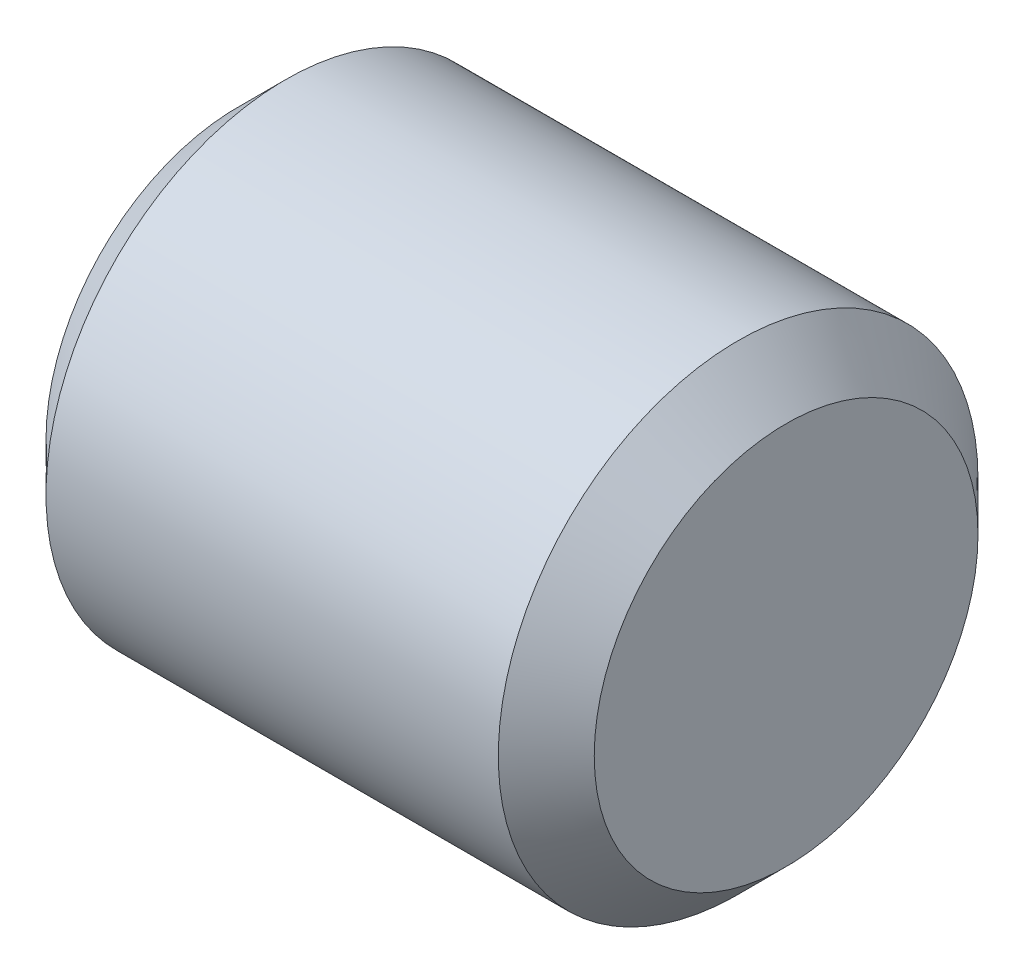
ISO-10303-21;
HEADER;
FILE_DESCRIPTION(('STEP AP214'),'2;1');
FILE_NAME('part.step','',(''),(''),'','','');
FILE_SCHEMA(('AUTOMOTIVE_DESIGN { 1 0 10303 214 1 1 1 1 }'));
ENDSEC;
DATA;
#1=APPLICATION_CONTEXT('core data for automotive mechanical design processes');
#2=APPLICATION_PROTOCOL_DEFINITION('international standard','automotive_design',2000,#1);
#3=PRODUCT_CONTEXT('',#1,'mechanical');
#4=PRODUCT('Part','Part','',(#3));
#5=PRODUCT_RELATED_PRODUCT_CATEGORY('part','',(#4));
#6=PRODUCT_DEFINITION_FORMATION('','',#4);
#7=PRODUCT_DEFINITION_CONTEXT('part definition',#1,'design');
#8=PRODUCT_DEFINITION('design','',#6,#7);
#9=PRODUCT_DEFINITION_SHAPE('','',#8);
#10=(LENGTH_UNIT() NAMED_UNIT(*) SI_UNIT(.MILLI.,.METRE.));
#11=(NAMED_UNIT(*) PLANE_ANGLE_UNIT() SI_UNIT($,.RADIAN.));
#12=(NAMED_UNIT(*) SI_UNIT($,.STERADIAN.) SOLID_ANGLE_UNIT());
#13=UNCERTAINTY_MEASURE_WITH_UNIT(LENGTH_MEASURE(1.E-05),#10,'distance_accuracy_value','');
#14=(GEOMETRIC_REPRESENTATION_CONTEXT(3) GLOBAL_UNCERTAINTY_ASSIGNED_CONTEXT((#13)) GLOBAL_UNIT_ASSIGNED_CONTEXT((#10,
#11,#12)) REPRESENTATION_CONTEXT('',''));
#15=CARTESIAN_POINT('',(0.,0.,0.));
#16=DIRECTION('',(0.,0.,1.));
#17=DIRECTION('',(1.,0.,0.));
#18=AXIS2_PLACEMENT_3D('',#15,#16,#17);
#19=CARTESIAN_POINT('',(-6.35,0.,0.));
#20=DIRECTION('',(1.,0.,0.));
#21=DIRECTION('',(0.,0.,-1.));
#22=AXIS2_PLACEMENT_3D('',#19,#20,#21);
#23=CYLINDRICAL_SURFACE('',#22,5.55625);
#24=CARTESIAN_POINT('',(5.23875,0.,0.));
#25=DIRECTION('',(1.,0.,0.));
#26=DIRECTION('',(0.,0.,-1.));
#27=AXIS2_PLACEMENT_3D('',#24,#25,#26);
#28=CIRCLE('',#27,5.55625);
#29=CARTESIAN_POINT('',(5.23875,0.,-5.55625));
#30=VERTEX_POINT('',#29);
#31=EDGE_CURVE('E40',#30,#30,#28,.F.);
#32=ORIENTED_EDGE('',*,*,#31,.T.);
#33=EDGE_LOOP('',(#32));
#34=FACE_BOUND('',#33,.T.);
#35=CARTESIAN_POINT('',(-5.23875,0.,0.));
#36=DIRECTION('',(1.,0.,0.));
#37=DIRECTION('',(0.,0.,-1.));
#38=AXIS2_PLACEMENT_3D('',#35,#36,#37);
#39=CIRCLE('',#38,5.55625);
#40=CARTESIAN_POINT('',(-5.23875,0.,-5.55625));
#41=VERTEX_POINT('',#40);
#42=EDGE_CURVE('E44',#41,#41,#39,.T.);
#43=ORIENTED_EDGE('',*,*,#42,.T.);
#44=EDGE_LOOP('',(#43));
#45=FACE_BOUND('',#44,.T.);
#46=ADVANCED_FACE('F33',(#34,#45),#23,.T.);
#47=CARTESIAN_POINT('',(-6.35,0.,0.));
#48=DIRECTION('',(1.,0.,0.));
#49=DIRECTION('',(0.,0.,-1.));
#50=AXIS2_PLACEMENT_3D('',#47,#48,#49);
#51=PLANE('',#50);
#52=CARTESIAN_POINT('',(-6.35,0.,0.));
#53=DIRECTION('',(1.,0.,0.));
#54=DIRECTION('',(0.,0.,-1.));
#55=AXIS2_PLACEMENT_3D('',#52,#53,#54);
#56=CIRCLE('',#55,4.445);
#57=CARTESIAN_POINT('',(-6.35,0.,-4.445));
#58=VERTEX_POINT('',#57);
#59=EDGE_CURVE('E10',#58,#58,#56,.F.);
#60=ORIENTED_EDGE('',*,*,#59,.T.);
#61=EDGE_LOOP('',(#60));
#62=FACE_BOUND('',#61,.T.);
#63=ADVANCED_FACE('F64',(#62),#51,.F.);
#64=CARTESIAN_POINT('',(6.35,0.,0.));
#65=DIRECTION('',(1.,0.,0.));
#66=DIRECTION('',(0.,0.,-1.));
#67=AXIS2_PLACEMENT_3D('',#64,#65,#66);
#68=PLANE('',#67);
#69=CARTESIAN_POINT('',(6.35,0.,0.));
#70=DIRECTION('',(1.,0.,0.));
#71=DIRECTION('',(0.,0.,-1.));
#72=AXIS2_PLACEMENT_3D('',#69,#70,#71);
#73=CIRCLE('',#72,4.445);
#74=CARTESIAN_POINT('',(6.35,0.,-4.445));
#75=VERTEX_POINT('',#74);
#76=EDGE_CURVE('E48',#75,#75,#73,.T.);
#77=ORIENTED_EDGE('',*,*,#76,.T.);
#78=EDGE_LOOP('',(#77));
#79=FACE_BOUND('',#78,.T.);
#80=ADVANCED_FACE('F54',(#79),#68,.T.);
#81=CARTESIAN_POINT('',(6.35,0.,0.));
#82=DIRECTION('',(-1.,0.,0.));
#83=DIRECTION('',(0.,0.,1.));
#84=AXIS2_PLACEMENT_3D('',#81,#82,#83);
#85=CONICAL_SURFACE('',#84,4.445,0.785398163397447);
#86=ORIENTED_EDGE('',*,*,#31,.F.);
#87=EDGE_LOOP('',(#86));
#88=FACE_BOUND('',#87,.T.);
#89=ORIENTED_EDGE('',*,*,#76,.F.);
#90=EDGE_LOOP('',(#89));
#91=FACE_BOUND('',#90,.T.);
#92=ADVANCED_FACE('F56',(#88,#91),#85,.T.);
#93=CARTESIAN_POINT('',(-5.23875,0.,0.));
#94=DIRECTION('',(1.,0.,0.));
#95=DIRECTION('',(0.,0.,-1.));
#96=AXIS2_PLACEMENT_3D('',#93,#94,#95);
#97=CONICAL_SURFACE('',#96,5.55625,0.78539816339745);
#98=ORIENTED_EDGE('',*,*,#59,.F.);
#99=EDGE_LOOP('',(#98));
#100=FACE_BOUND('',#99,.T.);
#101=ORIENTED_EDGE('',*,*,#42,.F.);
#102=EDGE_LOOP('',(#101));
#103=FACE_BOUND('',#102,.T.);
#104=ADVANCED_FACE('F35',(#100,#103),#97,.T.);
#105=CLOSED_SHELL('',(#46,#63,#80,#92,#104));
#106=MANIFOLD_SOLID_BREP('B2',#105);
#107=ADVANCED_BREP_SHAPE_REPRESENTATION('',(#18,#106),#14);
#108=SHAPE_DEFINITION_REPRESENTATION(#9,#107);
ENDSEC;
END-ISO-10303-21;
